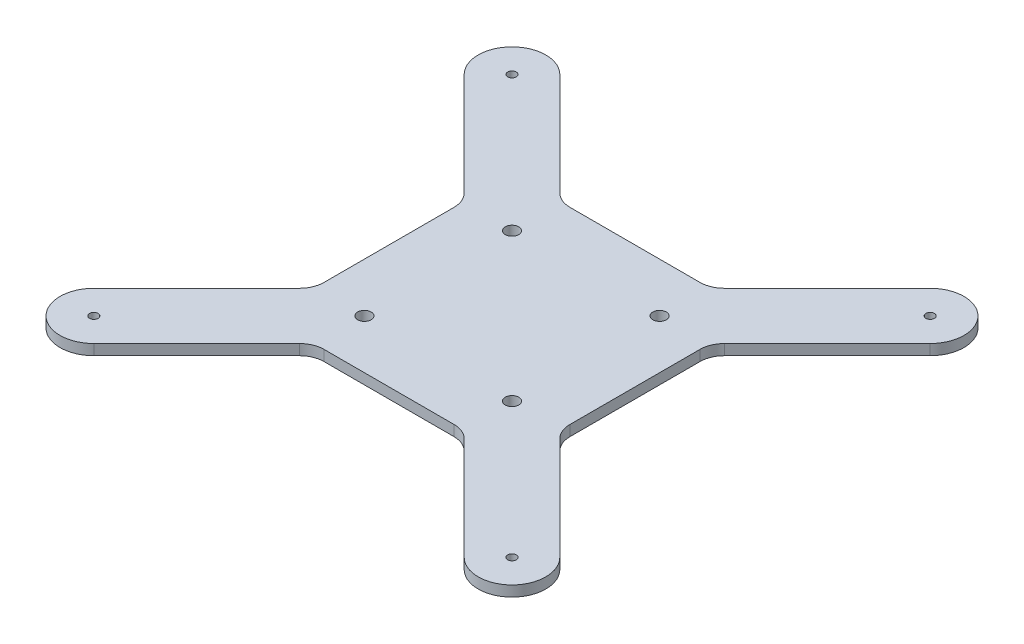
ISO-10303-21;
HEADER;
FILE_DESCRIPTION(('STEP AP214'),'2;1');
FILE_NAME('part.step','',(''),(''),'','','');
FILE_SCHEMA(('AUTOMOTIVE_DESIGN { 1 0 10303 214 1 1 1 1 }'));
ENDSEC;
DATA;
#1=APPLICATION_CONTEXT('core data for automotive mechanical design processes');
#2=APPLICATION_PROTOCOL_DEFINITION('international standard','automotive_design',2000,#1);
#3=PRODUCT_CONTEXT('',#1,'mechanical');
#4=PRODUCT('Part','Part','',(#3));
#5=PRODUCT_RELATED_PRODUCT_CATEGORY('part','',(#4));
#6=PRODUCT_DEFINITION_FORMATION('','',#4);
#7=PRODUCT_DEFINITION_CONTEXT('part definition',#1,'design');
#8=PRODUCT_DEFINITION('design','',#6,#7);
#9=PRODUCT_DEFINITION_SHAPE('','',#8);
#10=(LENGTH_UNIT() NAMED_UNIT(*) SI_UNIT(.MILLI.,.METRE.));
#11=(NAMED_UNIT(*) PLANE_ANGLE_UNIT() SI_UNIT($,.RADIAN.));
#12=(NAMED_UNIT(*) SI_UNIT($,.STERADIAN.) SOLID_ANGLE_UNIT());
#13=UNCERTAINTY_MEASURE_WITH_UNIT(LENGTH_MEASURE(1.E-05),#10,'distance_accuracy_value','');
#14=(GEOMETRIC_REPRESENTATION_CONTEXT(3) GLOBAL_UNCERTAINTY_ASSIGNED_CONTEXT((#13)) GLOBAL_UNIT_ASSIGNED_CONTEXT((#10,
#11,#12)) REPRESENTATION_CONTEXT('',''));
#15=CARTESIAN_POINT('',(0.,0.,0.));
#16=DIRECTION('',(0.,0.,1.));
#17=DIRECTION('',(1.,0.,0.));
#18=AXIS2_PLACEMENT_3D('',#15,#16,#17);
#19=CARTESIAN_POINT('',(0.,4.3,0.));
#20=DIRECTION('',(0.,-1.,0.));
#21=DIRECTION('',(0.,0.,-1.));
#22=AXIS2_PLACEMENT_3D('',#19,#20,#21);
#23=PLANE('',#22);
#24=DIRECTION('',(0.707106781186544,0.,0.707106781186551));
#25=VECTOR('',#24,1.);
#26=CARTESIAN_POINT('',(0.,4.3,-80.5545635173695));
#27=LINE('',#26,#25);
#28=CARTESIAN_POINT('',(-44.7227182413151,4.3,-125.277281758685));
#29=VERTEX_POINT('',#28);
#30=CARTESIAN_POINT('',(-2.92893218813448,4.3,-83.483495705504));
#31=VERTEX_POINT('',#30);
#32=EDGE_CURVE('E294',#29,#31,#27,.T.);
#33=ORIENTED_EDGE('',*,*,#32,.T.);
#34=CARTESIAN_POINT('',(-9.99999999999999,4.3,-76.4124278936386));
#35=DIRECTION('',(0.,-1.,0.));
#36=DIRECTION('',(0.,0.,-1.));
#37=AXIS2_PLACEMENT_3D('',#34,#35,#36);
#38=CIRCLE('',#37,10.);
#39=CARTESIAN_POINT('',(0.,4.3,-76.4124278936386));
#40=VERTEX_POINT('',#39);
#41=EDGE_CURVE('E47',#31,#40,#38,.T.);
#42=ORIENTED_EDGE('',*,*,#41,.T.);
#43=DIRECTION('',(0.,0.,1.));
#44=VECTOR('',#43,1.);
#45=CARTESIAN_POINT('',(0.,4.3,0.));
#46=LINE('',#45,#44);
#47=CARTESIAN_POINT('',(0.,4.3,-23.5875721063614));
#48=VERTEX_POINT('',#47);
#49=EDGE_CURVE('E344',#40,#48,#46,.T.);
#50=ORIENTED_EDGE('',*,*,#49,.T.);
#51=CARTESIAN_POINT('',(-10.,4.3,-23.5875721063614));
#52=DIRECTION('',(0.,-1.,0.));
#53=DIRECTION('',(0.,0.,-1.));
#54=AXIS2_PLACEMENT_3D('',#51,#52,#53);
#55=CIRCLE('',#54,10.);
#56=CARTESIAN_POINT('',(-2.92893218813448,4.3,-16.516504294496));
#57=VERTEX_POINT('',#56);
#58=EDGE_CURVE('E405',#48,#57,#55,.T.);
#59=ORIENTED_EDGE('',*,*,#58,.T.);
#60=DIRECTION('',(-0.707106781186544,0.,0.707106781186551));
#61=VECTOR('',#60,1.);
#62=CARTESIAN_POINT('',(-44.7227182413151,4.3,25.2772817586851));
#63=LINE('',#62,#61);
#64=CARTESIAN_POINT('',(-44.7227182413153,4.3,25.2772817586849));
#65=VERTEX_POINT('',#64);
#66=EDGE_CURVE('E226',#57,#65,#63,.T.);
#67=ORIENTED_EDGE('',*,*,#66,.T.);
#68=CARTESIAN_POINT('',(-34.9999999999996,4.3,34.9999999999993));
#69=DIRECTION('',(0.,1.,0.));
#70=DIRECTION('',(0.,0.,-1.));
#71=AXIS2_PLACEMENT_3D('',#68,#69,#70);
#72=CIRCLE('',#71,13.75);
#73=CARTESIAN_POINT('',(-25.277281758685,4.3,44.7227182413151));
#74=VERTEX_POINT('',#73);
#75=EDGE_CURVE('E222',#65,#74,#72,.T.);
#76=ORIENTED_EDGE('',*,*,#75,.T.);
#77=DIRECTION('',(0.707106781186551,0.,-0.707106781186544));
#78=VECTOR('',#77,1.);
#79=CARTESIAN_POINT('',(19.4454364826305,4.3,0.));
#80=LINE('',#79,#78);
#81=CARTESIAN_POINT('',(16.516504294496,4.3,2.92893218813449));
#82=VERTEX_POINT('',#81);
#83=EDGE_CURVE('E234',#74,#82,#80,.T.);
#84=ORIENTED_EDGE('',*,*,#83,.T.);
#85=CARTESIAN_POINT('',(23.5875721063615,4.3,10.));
#86=DIRECTION('',(0.,-1.,0.));
#87=DIRECTION('',(0.,0.,-1.));
#88=AXIS2_PLACEMENT_3D('',#85,#86,#87);
#89=CIRCLE('',#88,10.);
#90=CARTESIAN_POINT('',(23.5875721063615,4.3,0.));
#91=VERTEX_POINT('',#90);
#92=EDGE_CURVE('E409',#82,#91,#89,.T.);
#93=ORIENTED_EDGE('',*,*,#92,.T.);
#94=DIRECTION('',(1.,0.,0.));
#95=VECTOR('',#94,1.);
#96=CARTESIAN_POINT('',(0.,4.3,0.));
#97=LINE('',#96,#95);
#98=CARTESIAN_POINT('',(76.4124278936386,4.3,0.));
#99=VERTEX_POINT('',#98);
#100=EDGE_CURVE('E347',#91,#99,#97,.T.);
#101=ORIENTED_EDGE('',*,*,#100,.T.);
#102=CARTESIAN_POINT('',(76.4124278936386,4.3,10.));
#103=DIRECTION('',(0.,-1.,0.));
#104=DIRECTION('',(0.,0.,-1.));
#105=AXIS2_PLACEMENT_3D('',#102,#103,#104);
#106=CIRCLE('',#105,10.);
#107=CARTESIAN_POINT('',(83.483495705504,4.3,2.92893218813448));
#108=VERTEX_POINT('',#107);
#109=EDGE_CURVE('E413',#99,#108,#106,.T.);
#110=ORIENTED_EDGE('',*,*,#109,.T.);
#111=DIRECTION('',(0.707106781186551,0.,0.707106781186544));
#112=VECTOR('',#111,1.);
#113=CARTESIAN_POINT('',(125.277281758685,4.3,44.7227182413151));
#114=LINE('',#113,#112);
#115=CARTESIAN_POINT('',(125.277281758686,4.3,44.7227182413145));
#116=VERTEX_POINT('',#115);
#117=EDGE_CURVE('E260',#108,#116,#114,.T.);
#118=ORIENTED_EDGE('',*,*,#117,.T.);
#119=CARTESIAN_POINT('',(135.000000000001,4.3,34.9999999999996));
#120=DIRECTION('',(0.,1.,0.));
#121=DIRECTION('',(0.,0.,-1.));
#122=AXIS2_PLACEMENT_3D('',#119,#120,#121);
#123=CIRCLE('',#122,13.75);
#124=CARTESIAN_POINT('',(144.722718241315,4.3,25.277281758685));
#125=VERTEX_POINT('',#124);
#126=EDGE_CURVE('E262',#116,#125,#123,.T.);
#127=ORIENTED_EDGE('',*,*,#126,.T.);
#128=DIRECTION('',(-0.707106781186544,0.,-0.707106781186551));
#129=VECTOR('',#128,1.);
#130=CARTESIAN_POINT('',(100.,4.3,-19.4454364826305));
#131=LINE('',#130,#129);
#132=CARTESIAN_POINT('',(102.928932188134,4.3,-16.516504294496));
#133=VERTEX_POINT('',#132);
#134=EDGE_CURVE('E257',#125,#133,#131,.T.);
#135=ORIENTED_EDGE('',*,*,#134,.T.);
#136=CARTESIAN_POINT('',(110.,4.3,-23.5875721063615));
#137=DIRECTION('',(0.,-1.,0.));
#138=DIRECTION('',(0.,0.,-1.));
#139=AXIS2_PLACEMENT_3D('',#136,#137,#138);
#140=CIRCLE('',#139,10.);
#141=CARTESIAN_POINT('',(100.,4.3,-23.5875721063615));
#142=VERTEX_POINT('',#141);
#143=EDGE_CURVE('E417',#133,#142,#140,.T.);
#144=ORIENTED_EDGE('',*,*,#143,.T.);
#145=DIRECTION('',(0.,0.,-1.));
#146=VECTOR('',#145,1.);
#147=CARTESIAN_POINT('',(100.,4.3,0.));
#148=LINE('',#147,#146);
#149=CARTESIAN_POINT('',(100.,4.3,-76.4124278936385));
#150=VERTEX_POINT('',#149);
#151=EDGE_CURVE('E351',#142,#150,#148,.T.);
#152=ORIENTED_EDGE('',*,*,#151,.T.);
#153=CARTESIAN_POINT('',(110.,4.3,-76.4124278936385));
#154=DIRECTION('',(0.,-1.,0.));
#155=DIRECTION('',(0.,0.,-1.));
#156=AXIS2_PLACEMENT_3D('',#153,#154,#155);
#157=CIRCLE('',#156,10.);
#158=CARTESIAN_POINT('',(102.928932188134,4.3,-83.483495705504));
#159=VERTEX_POINT('',#158);
#160=EDGE_CURVE('E421',#150,#159,#157,.T.);
#161=ORIENTED_EDGE('',*,*,#160,.T.);
#162=DIRECTION('',(0.707106781186544,0.,-0.707106781186551));
#163=VECTOR('',#162,1.);
#164=CARTESIAN_POINT('',(144.722718241315,4.3,-125.277281758685));
#165=LINE('',#164,#163);
#166=CARTESIAN_POINT('',(144.722718241315,4.3,-125.277281758685));
#167=VERTEX_POINT('',#166);
#168=EDGE_CURVE('E287',#159,#167,#165,.T.);
#169=ORIENTED_EDGE('',*,*,#168,.T.);
#170=CARTESIAN_POINT('',(135.000000000001,4.3,-135.000000000001));
#171=DIRECTION('',(0.,1.,0.));
#172=DIRECTION('',(0.,0.,-1.));
#173=AXIS2_PLACEMENT_3D('',#170,#171,#172);
#174=CIRCLE('',#173,13.75);
#175=CARTESIAN_POINT('',(125.277281758685,4.3,-144.722718241315));
#176=VERTEX_POINT('',#175);
#177=EDGE_CURVE('E289',#167,#176,#174,.T.);
#178=ORIENTED_EDGE('',*,*,#177,.T.);
#179=DIRECTION('',(-0.707106781186551,0.,0.707106781186544));
#180=VECTOR('',#179,1.);
#181=CARTESIAN_POINT('',(80.5545635173695,4.3,-100.));
#182=LINE('',#181,#180);
#183=CARTESIAN_POINT('',(83.483495705504,4.3,-102.928932188134));
#184=VERTEX_POINT('',#183);
#185=EDGE_CURVE('E284',#176,#184,#182,.T.);
#186=ORIENTED_EDGE('',*,*,#185,.T.);
#187=CARTESIAN_POINT('',(76.4124278936386,4.3,-110.));
#188=DIRECTION('',(0.,-1.,0.));
#189=DIRECTION('',(0.,0.,-1.));
#190=AXIS2_PLACEMENT_3D('',#187,#188,#189);
#191=CIRCLE('',#190,10.);
#192=CARTESIAN_POINT('',(76.4124278936386,4.3,-100.));
#193=VERTEX_POINT('',#192);
#194=EDGE_CURVE('E425',#184,#193,#191,.T.);
#195=ORIENTED_EDGE('',*,*,#194,.T.);
#196=DIRECTION('',(-1.,0.,0.));
#197=VECTOR('',#196,1.);
#198=CARTESIAN_POINT('',(0.,4.3,-100.));
#199=LINE('',#198,#197);
#200=CARTESIAN_POINT('',(23.5875721063615,4.3,-100.));
#201=VERTEX_POINT('',#200);
#202=EDGE_CURVE('E354',#193,#201,#199,.T.);
#203=ORIENTED_EDGE('',*,*,#202,.T.);
#204=CARTESIAN_POINT('',(23.5875721063615,4.3,-110.));
#205=DIRECTION('',(0.,-1.,0.));
#206=DIRECTION('',(0.,0.,-1.));
#207=AXIS2_PLACEMENT_3D('',#204,#205,#206);
#208=CIRCLE('',#207,10.);
#209=CARTESIAN_POINT('',(16.516504294496,4.3,-102.928932188135));
#210=VERTEX_POINT('',#209);
#211=EDGE_CURVE('E429',#201,#210,#208,.T.);
#212=ORIENTED_EDGE('',*,*,#211,.T.);
#213=DIRECTION('',(-0.707106781186551,0.,-0.707106781186543));
#214=VECTOR('',#213,1.);
#215=CARTESIAN_POINT('',(-25.277281758685,4.3,-144.722718241315));
#216=LINE('',#215,#214);
#217=CARTESIAN_POINT('',(-25.277281758685,4.3,-144.722718241315));
#218=VERTEX_POINT('',#217);
#219=EDGE_CURVE('E301',#210,#218,#216,.T.);
#220=ORIENTED_EDGE('',*,*,#219,.T.);
#221=CARTESIAN_POINT('',(-35.,4.3,-135.));
#222=DIRECTION('',(0.,1.,0.));
#223=DIRECTION('',(0.,0.,-1.));
#224=AXIS2_PLACEMENT_3D('',#221,#222,#223);
#225=CIRCLE('',#224,13.75);
#226=EDGE_CURVE('E298',#218,#29,#225,.T.);
#227=ORIENTED_EDGE('',*,*,#226,.T.);
#228=EDGE_LOOP('',(#33,#42,#50,#59,#67,#76,#84,#93,#101,#110,#118,#127,#135,#144,#152,#161,#169,
#178,#186,#195,#203,#212,#220,#227));
#229=FACE_BOUND('',#228,.T.);
#230=CARTESIAN_POINT('',(20.,4.3,-80.));
#231=DIRECTION('',(0.,1.,0.));
#232=DIRECTION('',(0.,0.,1.));
#233=AXIS2_PLACEMENT_3D('',#230,#231,#232);
#234=CIRCLE('',#233,2.75);
#235=CARTESIAN_POINT('',(20.,4.3,-77.25));
#236=VERTEX_POINT('',#235);
#237=EDGE_CURVE('E338',#236,#236,#234,.T.);
#238=ORIENTED_EDGE('',*,*,#237,.F.);
#239=EDGE_LOOP('',(#238));
#240=FACE_BOUND('',#239,.T.);
#241=CARTESIAN_POINT('',(80.,4.3,-80.));
#242=DIRECTION('',(0.,1.,0.));
#243=DIRECTION('',(0.,0.,-1.));
#244=AXIS2_PLACEMENT_3D('',#241,#242,#243);
#245=CIRCLE('',#244,2.75000000000001);
#246=CARTESIAN_POINT('',(80.,4.3,-82.75));
#247=VERTEX_POINT('',#246);
#248=EDGE_CURVE('E332',#247,#247,#245,.T.);
#249=ORIENTED_EDGE('',*,*,#248,.F.);
#250=EDGE_LOOP('',(#249));
#251=FACE_BOUND('',#250,.T.);
#252=CARTESIAN_POINT('',(80.,4.3,-20.));
#253=DIRECTION('',(0.,1.,0.));
#254=DIRECTION('',(0.,0.,1.));
#255=AXIS2_PLACEMENT_3D('',#252,#253,#254);
#256=CIRCLE('',#255,2.75000000000001);
#257=CARTESIAN_POINT('',(80.,4.3,-17.25));
#258=VERTEX_POINT('',#257);
#259=EDGE_CURVE('E326',#258,#258,#256,.T.);
#260=ORIENTED_EDGE('',*,*,#259,.F.);
#261=EDGE_LOOP('',(#260));
#262=FACE_BOUND('',#261,.T.);
#263=CARTESIAN_POINT('',(20.,4.3,-20.));
#264=DIRECTION('',(0.,1.,0.));
#265=DIRECTION('',(0.,0.,-1.));
#266=AXIS2_PLACEMENT_3D('',#263,#264,#265);
#267=CIRCLE('',#266,2.75);
#268=CARTESIAN_POINT('',(20.,4.3,-22.75));
#269=VERTEX_POINT('',#268);
#270=EDGE_CURVE('E320',#269,#269,#267,.T.);
#271=ORIENTED_EDGE('',*,*,#270,.F.);
#272=EDGE_LOOP('',(#271));
#273=FACE_BOUND('',#272,.T.);
#274=CARTESIAN_POINT('',(-35.,4.3,-135.));
#275=DIRECTION('',(0.,1.,0.));
#276=DIRECTION('',(0.,0.,1.));
#277=AXIS2_PLACEMENT_3D('',#274,#275,#276);
#278=CIRCLE('',#277,1.75);
#279=CARTESIAN_POINT('',(-35.,4.3,-133.25));
#280=VERTEX_POINT('',#279);
#281=EDGE_CURVE('E303',#280,#280,#278,.T.);
#282=ORIENTED_EDGE('',*,*,#281,.F.);
#283=EDGE_LOOP('',(#282));
#284=FACE_BOUND('',#283,.T.);
#285=CARTESIAN_POINT('',(135.,4.3,-135.));
#286=DIRECTION('',(0.,1.,0.));
#287=DIRECTION('',(0.,0.,-1.));
#288=AXIS2_PLACEMENT_3D('',#285,#286,#287);
#289=CIRCLE('',#288,1.75000000000001);
#290=CARTESIAN_POINT('',(135.,4.3,-136.75));
#291=VERTEX_POINT('',#290);
#292=EDGE_CURVE('E271',#291,#291,#289,.T.);
#293=ORIENTED_EDGE('',*,*,#292,.F.);
#294=EDGE_LOOP('',(#293));
#295=FACE_BOUND('',#294,.T.);
#296=CARTESIAN_POINT('',(135.,4.3,35.));
#297=DIRECTION('',(0.,1.,0.));
#298=DIRECTION('',(0.,0.,1.));
#299=AXIS2_PLACEMENT_3D('',#296,#297,#298);
#300=CIRCLE('',#299,1.75000000000001);
#301=CARTESIAN_POINT('',(135.,4.3,36.75));
#302=VERTEX_POINT('',#301);
#303=EDGE_CURVE('E244',#302,#302,#300,.T.);
#304=ORIENTED_EDGE('',*,*,#303,.F.);
#305=EDGE_LOOP('',(#304));
#306=FACE_BOUND('',#305,.T.);
#307=CARTESIAN_POINT('',(-35.,4.3,35.));
#308=DIRECTION('',(0.,1.,0.));
#309=DIRECTION('',(0.,0.,-1.));
#310=AXIS2_PLACEMENT_3D('',#307,#308,#309);
#311=CIRCLE('',#310,1.75);
#312=CARTESIAN_POINT('',(-35.,4.3,33.25));
#313=VERTEX_POINT('',#312);
#314=EDGE_CURVE('E223',#313,#313,#311,.T.);
#315=ORIENTED_EDGE('',*,*,#314,.F.);
#316=EDGE_LOOP('',(#315));
#317=FACE_BOUND('',#316,.T.);
#318=ADVANCED_FACE('F39',(#229,#240,#251,#262,#273,#284,#295,#306,#317),#23,.F.);
#319=CARTESIAN_POINT('',(0.,0.,0.));
#320=DIRECTION('',(0.,-1.,0.));
#321=DIRECTION('',(0.,0.,-1.));
#322=AXIS2_PLACEMENT_3D('',#319,#320,#321);
#323=PLANE('',#322);
#324=DIRECTION('',(-0.707106781186544,0.,0.707106781186552));
#325=VECTOR('',#324,1.);
#326=CARTESIAN_POINT('',(-44.7227182413151,0.,25.2772817586851));
#327=LINE('',#326,#325);
#328=CARTESIAN_POINT('',(-2.92893218813448,0.,-16.516504294496));
#329=VERTEX_POINT('',#328);
#330=CARTESIAN_POINT('',(-44.7227182413149,0.,25.2772817586849));
#331=VERTEX_POINT('',#330);
#332=EDGE_CURVE('E199',#329,#331,#327,.T.);
#333=ORIENTED_EDGE('',*,*,#332,.F.);
#334=CARTESIAN_POINT('',(-10.,0.,-23.5875721063614));
#335=DIRECTION('',(0.,-1.,0.));
#336=DIRECTION('',(0.,0.,-1.));
#337=AXIS2_PLACEMENT_3D('',#334,#335,#336);
#338=CIRCLE('',#337,10.);
#339=CARTESIAN_POINT('',(0.,0.,-23.5875721063614));
#340=VERTEX_POINT('',#339);
#341=EDGE_CURVE('E407',#329,#340,#338,.F.);
#342=ORIENTED_EDGE('',*,*,#341,.T.);
#343=DIRECTION('',(0.,0.,1.));
#344=VECTOR('',#343,1.);
#345=CARTESIAN_POINT('',(0.,0.,0.));
#346=LINE('',#345,#344);
#347=CARTESIAN_POINT('',(0.,0.,-76.4124278936386));
#348=VERTEX_POINT('',#347);
#349=EDGE_CURVE('E341',#348,#340,#346,.T.);
#350=ORIENTED_EDGE('',*,*,#349,.F.);
#351=CARTESIAN_POINT('',(-9.99999999999999,0.,-76.4124278936386));
#352=DIRECTION('',(0.,-1.,0.));
#353=DIRECTION('',(0.,0.,-1.));
#354=AXIS2_PLACEMENT_3D('',#351,#352,#353);
#355=CIRCLE('',#354,10.);
#356=CARTESIAN_POINT('',(-2.92893218813448,0.,-83.483495705504));
#357=VERTEX_POINT('',#356);
#358=EDGE_CURVE('E11',#348,#357,#355,.F.);
#359=ORIENTED_EDGE('',*,*,#358,.T.);
#360=DIRECTION('',(0.707106781186544,0.,0.707106781186551));
#361=VECTOR('',#360,1.);
#362=CARTESIAN_POINT('',(0.,0.,-80.5545635173695));
#363=LINE('',#362,#361);
#364=CARTESIAN_POINT('',(-44.7227182413151,0.,-125.277281758685));
#365=VERTEX_POINT('',#364);
#366=EDGE_CURVE('E281',#365,#357,#363,.T.);
#367=ORIENTED_EDGE('',*,*,#366,.F.);
#368=CARTESIAN_POINT('',(-35.,0.,-135.));
#369=DIRECTION('',(0.,-1.,0.));
#370=DIRECTION('',(0.,0.,-1.));
#371=AXIS2_PLACEMENT_3D('',#368,#369,#370);
#372=CIRCLE('',#371,13.75);
#373=CARTESIAN_POINT('',(-25.277281758685,0.,-144.722718241315));
#374=VERTEX_POINT('',#373);
#375=EDGE_CURVE('E311',#374,#365,#372,.F.);
#376=ORIENTED_EDGE('',*,*,#375,.F.);
#377=DIRECTION('',(-0.707106781186551,0.,-0.707106781186544));
#378=VECTOR('',#377,1.);
#379=CARTESIAN_POINT('',(-25.277281758685,0.,-144.722718241315));
#380=LINE('',#379,#378);
#381=CARTESIAN_POINT('',(16.5165042944961,0.,-102.928932188134));
#382=VERTEX_POINT('',#381);
#383=EDGE_CURVE('E315',#382,#374,#380,.T.);
#384=ORIENTED_EDGE('',*,*,#383,.F.);
#385=CARTESIAN_POINT('',(23.5875721063615,0.,-110.));
#386=DIRECTION('',(0.,-1.,0.));
#387=DIRECTION('',(0.,0.,-1.));
#388=AXIS2_PLACEMENT_3D('',#385,#386,#387);
#389=CIRCLE('',#388,10.);
#390=CARTESIAN_POINT('',(23.5875721063615,0.,-100.));
#391=VERTEX_POINT('',#390);
#392=EDGE_CURVE('E431',#382,#391,#389,.F.);
#393=ORIENTED_EDGE('',*,*,#392,.T.);
#394=DIRECTION('',(-1.,0.,0.));
#395=VECTOR('',#394,1.);
#396=CARTESIAN_POINT('',(0.,0.,-100.));
#397=LINE('',#396,#395);
#398=CARTESIAN_POINT('',(76.4124278936386,0.,-100.));
#399=VERTEX_POINT('',#398);
#400=EDGE_CURVE('E348',#399,#391,#397,.T.);
#401=ORIENTED_EDGE('',*,*,#400,.F.);
#402=CARTESIAN_POINT('',(76.4124278936386,0.,-110.));
#403=DIRECTION('',(0.,-1.,0.));
#404=DIRECTION('',(0.,0.,-1.));
#405=AXIS2_PLACEMENT_3D('',#402,#403,#404);
#406=CIRCLE('',#405,10.);
#407=CARTESIAN_POINT('',(83.483495705504,0.,-102.928932188134));
#408=VERTEX_POINT('',#407);
#409=EDGE_CURVE('E427',#399,#408,#406,.F.);
#410=ORIENTED_EDGE('',*,*,#409,.T.);
#411=DIRECTION('',(-0.707106781186551,0.,0.707106781186544));
#412=VECTOR('',#411,1.);
#413=CARTESIAN_POINT('',(80.5545635173695,0.,-100.));
#414=LINE('',#413,#412);
#415=CARTESIAN_POINT('',(125.277281758685,0.,-144.722718241315));
#416=VERTEX_POINT('',#415);
#417=EDGE_CURVE('E278',#416,#408,#414,.T.);
#418=ORIENTED_EDGE('',*,*,#417,.F.);
#419=CARTESIAN_POINT('',(135.000000000001,0.,-135.000000000001));
#420=DIRECTION('',(0.,-1.,0.));
#421=DIRECTION('',(0.,0.,-1.));
#422=AXIS2_PLACEMENT_3D('',#419,#420,#421);
#423=CIRCLE('',#422,13.75);
#424=CARTESIAN_POINT('',(144.722718241315,0.,-125.277281758685));
#425=VERTEX_POINT('',#424);
#426=EDGE_CURVE('E274',#425,#416,#423,.F.);
#427=ORIENTED_EDGE('',*,*,#426,.F.);
#428=DIRECTION('',(0.707106781186544,0.,-0.707106781186551));
#429=VECTOR('',#428,1.);
#430=CARTESIAN_POINT('',(144.722718241315,0.,-125.277281758685));
#431=LINE('',#430,#429);
#432=CARTESIAN_POINT('',(102.928932188134,0.,-83.483495705504));
#433=VERTEX_POINT('',#432);
#434=EDGE_CURVE('E270',#433,#425,#431,.T.);
#435=ORIENTED_EDGE('',*,*,#434,.F.);
#436=CARTESIAN_POINT('',(110.,0.,-76.4124278936385));
#437=DIRECTION('',(0.,-1.,0.));
#438=DIRECTION('',(0.,0.,-1.));
#439=AXIS2_PLACEMENT_3D('',#436,#437,#438);
#440=CIRCLE('',#439,10.);
#441=CARTESIAN_POINT('',(100.,0.,-76.4124278936385));
#442=VERTEX_POINT('',#441);
#443=EDGE_CURVE('E423',#433,#442,#440,.F.);
#444=ORIENTED_EDGE('',*,*,#443,.T.);
#445=DIRECTION('',(0.,0.,-1.));
#446=VECTOR('',#445,1.);
#447=CARTESIAN_POINT('',(100.,0.,0.));
#448=LINE('',#447,#446);
#449=CARTESIAN_POINT('',(100.,0.,-23.5875721063615));
#450=VERTEX_POINT('',#449);
#451=EDGE_CURVE('E363',#450,#442,#448,.T.);
#452=ORIENTED_EDGE('',*,*,#451,.F.);
#453=CARTESIAN_POINT('',(110.,0.,-23.5875721063615));
#454=DIRECTION('',(0.,-1.,0.));
#455=DIRECTION('',(0.,0.,-1.));
#456=AXIS2_PLACEMENT_3D('',#453,#454,#455);
#457=CIRCLE('',#456,10.);
#458=CARTESIAN_POINT('',(102.928932188134,0.,-16.516504294496));
#459=VERTEX_POINT('',#458);
#460=EDGE_CURVE('E419',#450,#459,#457,.F.);
#461=ORIENTED_EDGE('',*,*,#460,.T.);
#462=DIRECTION('',(-0.707106781186544,0.,-0.707106781186551));
#463=VECTOR('',#462,1.);
#464=CARTESIAN_POINT('',(100.,0.,-19.4454364826305));
#465=LINE('',#464,#463);
#466=CARTESIAN_POINT('',(144.722718241316,0.,25.2772817586844));
#467=VERTEX_POINT('',#466);
#468=EDGE_CURVE('E251',#467,#459,#465,.T.);
#469=ORIENTED_EDGE('',*,*,#468,.F.);
#470=CARTESIAN_POINT('',(135.000000000001,0.,34.9999999999996));
#471=DIRECTION('',(0.,-1.,0.));
#472=DIRECTION('',(0.,0.,-1.));
#473=AXIS2_PLACEMENT_3D('',#470,#471,#472);
#474=CIRCLE('',#473,13.75);
#475=CARTESIAN_POINT('',(125.277281758684,0.,44.7227182413145));
#476=VERTEX_POINT('',#475);
#477=EDGE_CURVE('E247',#476,#467,#474,.F.);
#478=ORIENTED_EDGE('',*,*,#477,.F.);
#479=DIRECTION('',(0.707106781186552,0.,0.707106781186544));
#480=VECTOR('',#479,1.);
#481=CARTESIAN_POINT('',(125.277281758685,0.,44.7227182413151));
#482=LINE('',#481,#480);
#483=CARTESIAN_POINT('',(83.483495705504,0.,2.92893218813448));
#484=VERTEX_POINT('',#483);
#485=EDGE_CURVE('E243',#484,#476,#482,.T.);
#486=ORIENTED_EDGE('',*,*,#485,.F.);
#487=CARTESIAN_POINT('',(76.4124278936386,0.,10.));
#488=DIRECTION('',(0.,-1.,0.));
#489=DIRECTION('',(0.,0.,-1.));
#490=AXIS2_PLACEMENT_3D('',#487,#488,#489);
#491=CIRCLE('',#490,10.);
#492=CARTESIAN_POINT('',(76.4124278936386,0.,0.));
#493=VERTEX_POINT('',#492);
#494=EDGE_CURVE('E415',#484,#493,#491,.F.);
#495=ORIENTED_EDGE('',*,*,#494,.T.);
#496=DIRECTION('',(1.,0.,0.));
#497=VECTOR('',#496,1.);
#498=CARTESIAN_POINT('',(0.,0.,0.));
#499=LINE('',#498,#497);
#500=CARTESIAN_POINT('',(23.5875721063615,0.,0.));
#501=VERTEX_POINT('',#500);
#502=EDGE_CURVE('E360',#501,#493,#499,.T.);
#503=ORIENTED_EDGE('',*,*,#502,.F.);
#504=CARTESIAN_POINT('',(23.5875721063615,0.,10.));
#505=DIRECTION('',(0.,-1.,0.));
#506=DIRECTION('',(0.,0.,-1.));
#507=AXIS2_PLACEMENT_3D('',#504,#505,#506);
#508=CIRCLE('',#507,10.);
#509=CARTESIAN_POINT('',(16.516504294496,0.,2.92893218813449));
#510=VERTEX_POINT('',#509);
#511=EDGE_CURVE('E411',#501,#510,#508,.F.);
#512=ORIENTED_EDGE('',*,*,#511,.T.);
#513=DIRECTION('',(0.707106781186551,0.,-0.707106781186544));
#514=VECTOR('',#513,1.);
#515=CARTESIAN_POINT('',(19.4454364826305,0.,0.));
#516=LINE('',#515,#514);
#517=CARTESIAN_POINT('',(-25.2772817586852,0.,44.7227182413149));
#518=VERTEX_POINT('',#517);
#519=EDGE_CURVE('E216',#518,#510,#516,.T.);
#520=ORIENTED_EDGE('',*,*,#519,.F.);
#521=CARTESIAN_POINT('',(-34.9999999999996,0.,34.9999999999993));
#522=DIRECTION('',(0.,-1.,0.));
#523=DIRECTION('',(0.,0.,-1.));
#524=AXIS2_PLACEMENT_3D('',#521,#522,#523);
#525=CIRCLE('',#524,13.75);
#526=EDGE_CURVE('E212',#331,#518,#525,.F.);
#527=ORIENTED_EDGE('',*,*,#526,.F.);
#528=EDGE_LOOP('',(#333,#342,#350,#359,#367,#376,#384,#393,#401,#410,#418,#427,#435,#444,#452,
#461,#469,#478,#486,#495,#503,#512,#520,#527));
#529=FACE_BOUND('',#528,.T.);
#530=CARTESIAN_POINT('',(80.,0.,-20.));
#531=DIRECTION('',(0.,1.,0.));
#532=DIRECTION('',(0.,0.,1.));
#533=AXIS2_PLACEMENT_3D('',#530,#531,#532);
#534=CIRCLE('',#533,2.75000000000001);
#535=CARTESIAN_POINT('',(80.,0.,-17.25));
#536=VERTEX_POINT('',#535);
#537=EDGE_CURVE('E323',#536,#536,#534,.T.);
#538=ORIENTED_EDGE('',*,*,#537,.T.);
#539=EDGE_LOOP('',(#538));
#540=FACE_BOUND('',#539,.T.);
#541=CARTESIAN_POINT('',(20.,0.,-80.));
#542=DIRECTION('',(0.,1.,0.));
#543=DIRECTION('',(0.,0.,1.));
#544=AXIS2_PLACEMENT_3D('',#541,#542,#543);
#545=CIRCLE('',#544,2.75);
#546=CARTESIAN_POINT('',(20.,0.,-77.25));
#547=VERTEX_POINT('',#546);
#548=EDGE_CURVE('E335',#547,#547,#545,.T.);
#549=ORIENTED_EDGE('',*,*,#548,.T.);
#550=EDGE_LOOP('',(#549));
#551=FACE_BOUND('',#550,.T.);
#552=CARTESIAN_POINT('',(80.,0.,-80.));
#553=DIRECTION('',(0.,1.,0.));
#554=DIRECTION('',(0.,0.,-1.));
#555=AXIS2_PLACEMENT_3D('',#552,#553,#554);
#556=CIRCLE('',#555,2.75000000000001);
#557=CARTESIAN_POINT('',(80.,0.,-82.75));
#558=VERTEX_POINT('',#557);
#559=EDGE_CURVE('E329',#558,#558,#556,.T.);
#560=ORIENTED_EDGE('',*,*,#559,.T.);
#561=EDGE_LOOP('',(#560));
#562=FACE_BOUND('',#561,.T.);
#563=CARTESIAN_POINT('',(20.,0.,-20.));
#564=DIRECTION('',(0.,1.,0.));
#565=DIRECTION('',(0.,0.,-1.));
#566=AXIS2_PLACEMENT_3D('',#563,#564,#565);
#567=CIRCLE('',#566,2.75);
#568=CARTESIAN_POINT('',(20.,0.,-22.75));
#569=VERTEX_POINT('',#568);
#570=EDGE_CURVE('E309',#569,#569,#567,.T.);
#571=ORIENTED_EDGE('',*,*,#570,.T.);
#572=EDGE_LOOP('',(#571));
#573=FACE_BOUND('',#572,.T.);
#574=CARTESIAN_POINT('',(-35.,0.,-135.));
#575=DIRECTION('',(0.,-1.,0.));
#576=DIRECTION('',(0.,0.,-1.));
#577=AXIS2_PLACEMENT_3D('',#574,#575,#576);
#578=CIRCLE('',#577,1.75);
#579=CARTESIAN_POINT('',(-35.,0.,-136.75));
#580=VERTEX_POINT('',#579);
#581=EDGE_CURVE('E297',#580,#580,#578,.F.);
#582=ORIENTED_EDGE('',*,*,#581,.T.);
#583=EDGE_LOOP('',(#582));
#584=FACE_BOUND('',#583,.T.);
#585=CARTESIAN_POINT('',(135.,0.,-135.));
#586=DIRECTION('',(0.,-1.,0.));
#587=DIRECTION('',(0.,0.,-1.));
#588=AXIS2_PLACEMENT_3D('',#585,#586,#587);
#589=CIRCLE('',#588,1.75000000000001);
#590=CARTESIAN_POINT('',(135.,0.,-136.75));
#591=VERTEX_POINT('',#590);
#592=EDGE_CURVE('E254',#591,#591,#589,.F.);
#593=ORIENTED_EDGE('',*,*,#592,.T.);
#594=EDGE_LOOP('',(#593));
#595=FACE_BOUND('',#594,.T.);
#596=CARTESIAN_POINT('',(135.,0.,35.));
#597=DIRECTION('',(0.,-1.,0.));
#598=DIRECTION('',(0.,0.,-1.));
#599=AXIS2_PLACEMENT_3D('',#596,#597,#598);
#600=CIRCLE('',#599,1.75000000000001);
#601=CARTESIAN_POINT('',(135.,0.,33.25));
#602=VERTEX_POINT('',#601);
#603=EDGE_CURVE('E231',#602,#602,#600,.F.);
#604=ORIENTED_EDGE('',*,*,#603,.T.);
#605=EDGE_LOOP('',(#604));
#606=FACE_BOUND('',#605,.T.);
#607=CARTESIAN_POINT('',(-35.,0.,35.));
#608=DIRECTION('',(0.,-1.,0.));
#609=DIRECTION('',(0.,0.,-1.));
#610=AXIS2_PLACEMENT_3D('',#607,#608,#609);
#611=CIRCLE('',#610,1.75);
#612=CARTESIAN_POINT('',(-35.,0.,33.25));
#613=VERTEX_POINT('',#612);
#614=EDGE_CURVE('E232',#613,#613,#611,.F.);
#615=ORIENTED_EDGE('',*,*,#614,.T.);
#616=EDGE_LOOP('',(#615));
#617=FACE_BOUND('',#616,.T.);
#618=ADVANCED_FACE('F213',(#529,#540,#551,#562,#573,#584,#595,#606,#617),#323,.T.);
#619=CARTESIAN_POINT('',(0.,4.3,0.));
#620=DIRECTION('',(1.,0.,0.));
#621=DIRECTION('',(0.,0.,-1.));
#622=AXIS2_PLACEMENT_3D('',#619,#620,#621);
#623=PLANE('',#622);
#624=ORIENTED_EDGE('',*,*,#349,.T.);
#625=DIRECTION('',(0.,1.,0.));
#626=VECTOR('',#625,1.);
#627=CARTESIAN_POINT('',(0.,4.3,-23.5875721063614));
#628=LINE('',#627,#626);
#629=EDGE_CURVE('E369',#340,#48,#628,.T.);
#630=ORIENTED_EDGE('',*,*,#629,.T.);
#631=ORIENTED_EDGE('',*,*,#49,.F.);
#632=DIRECTION('',(0.,1.,0.));
#633=VECTOR('',#632,1.);
#634=CARTESIAN_POINT('',(0.,4.3,-76.4124278936386));
#635=LINE('',#634,#633);
#636=EDGE_CURVE('E357',#40,#348,#635,.F.);
#637=ORIENTED_EDGE('',*,*,#636,.T.);
#638=EDGE_LOOP('',(#624,#630,#631,#637));
#639=FACE_BOUND('',#638,.T.);
#640=ADVANCED_FACE('F437',(#639),#623,.F.);
#641=CARTESIAN_POINT('',(0.,4.3,0.));
#642=DIRECTION('',(0.,0.,-1.));
#643=DIRECTION('',(-1.,0.,0.));
#644=AXIS2_PLACEMENT_3D('',#641,#642,#643);
#645=PLANE('',#644);
#646=ORIENTED_EDGE('',*,*,#100,.F.);
#647=DIRECTION('',(0.,1.,0.));
#648=VECTOR('',#647,1.);
#649=CARTESIAN_POINT('',(23.5875721063615,4.3,0.));
#650=LINE('',#649,#648);
#651=EDGE_CURVE('E379',#91,#501,#650,.F.);
#652=ORIENTED_EDGE('',*,*,#651,.T.);
#653=ORIENTED_EDGE('',*,*,#502,.T.);
#654=DIRECTION('',(0.,1.,0.));
#655=VECTOR('',#654,1.);
#656=CARTESIAN_POINT('',(76.4124278936386,4.3,0.));
#657=LINE('',#656,#655);
#658=EDGE_CURVE('E376',#493,#99,#657,.T.);
#659=ORIENTED_EDGE('',*,*,#658,.T.);
#660=EDGE_LOOP('',(#646,#652,#653,#659));
#661=FACE_BOUND('',#660,.T.);
#662=ADVANCED_FACE('F513',(#661),#645,.F.);
#663=CARTESIAN_POINT('',(100.,4.3,0.));
#664=DIRECTION('',(-1.,0.,0.));
#665=DIRECTION('',(0.,0.,1.));
#666=AXIS2_PLACEMENT_3D('',#663,#664,#665);
#667=PLANE('',#666);
#668=ORIENTED_EDGE('',*,*,#151,.F.);
#669=DIRECTION('',(0.,1.,0.));
#670=VECTOR('',#669,1.);
#671=CARTESIAN_POINT('',(100.,4.3,-23.5875721063615));
#672=LINE('',#671,#670);
#673=EDGE_CURVE('E389',#142,#450,#672,.F.);
#674=ORIENTED_EDGE('',*,*,#673,.T.);
#675=ORIENTED_EDGE('',*,*,#451,.T.);
#676=DIRECTION('',(0.,1.,0.));
#677=VECTOR('',#676,1.);
#678=CARTESIAN_POINT('',(100.,4.3,-76.4124278936385));
#679=LINE('',#678,#677);
#680=EDGE_CURVE('E386',#442,#150,#679,.T.);
#681=ORIENTED_EDGE('',*,*,#680,.T.);
#682=EDGE_LOOP('',(#668,#674,#675,#681));
#683=FACE_BOUND('',#682,.T.);
#684=ADVANCED_FACE('F484',(#683),#667,.F.);
#685=CARTESIAN_POINT('',(0.,4.3,-100.));
#686=DIRECTION('',(0.,0.,1.));
#687=DIRECTION('',(1.,0.,0.));
#688=AXIS2_PLACEMENT_3D('',#685,#686,#687);
#689=PLANE('',#688);
#690=ORIENTED_EDGE('',*,*,#202,.F.);
#691=DIRECTION('',(0.,1.,0.));
#692=VECTOR('',#691,1.);
#693=CARTESIAN_POINT('',(76.4124278936386,4.3,-100.));
#694=LINE('',#693,#692);
#695=EDGE_CURVE('E399',#193,#399,#694,.F.);
#696=ORIENTED_EDGE('',*,*,#695,.T.);
#697=ORIENTED_EDGE('',*,*,#400,.T.);
#698=DIRECTION('',(0.,1.,0.));
#699=VECTOR('',#698,1.);
#700=CARTESIAN_POINT('',(23.5875721063615,4.3,-100.));
#701=LINE('',#700,#699);
#702=EDGE_CURVE('E396',#391,#201,#701,.T.);
#703=ORIENTED_EDGE('',*,*,#702,.T.);
#704=EDGE_LOOP('',(#690,#696,#697,#703));
#705=FACE_BOUND('',#704,.T.);
#706=ADVANCED_FACE('F460',(#705),#689,.F.);
#707=CARTESIAN_POINT('',(20.,4.3,-80.));
#708=DIRECTION('',(0.,-1.,0.));
#709=DIRECTION('',(0.,0.,-1.));
#710=AXIS2_PLACEMENT_3D('',#707,#708,#709);
#711=CYLINDRICAL_SURFACE('',#710,2.75);
#712=ORIENTED_EDGE('',*,*,#237,.T.);
#713=EDGE_LOOP('',(#712));
#714=FACE_BOUND('',#713,.T.);
#715=ORIENTED_EDGE('',*,*,#548,.F.);
#716=EDGE_LOOP('',(#715));
#717=FACE_BOUND('',#716,.T.);
#718=ADVANCED_FACE('F542',(#714,#717),#711,.F.);
#719=CARTESIAN_POINT('',(80.,4.3,-80.));
#720=DIRECTION('',(0.,-1.,0.));
#721=DIRECTION('',(0.,0.,-1.));
#722=AXIS2_PLACEMENT_3D('',#719,#720,#721);
#723=CYLINDRICAL_SURFACE('',#722,2.75000000000001);
#724=ORIENTED_EDGE('',*,*,#248,.T.);
#725=EDGE_LOOP('',(#724));
#726=FACE_BOUND('',#725,.T.);
#727=ORIENTED_EDGE('',*,*,#559,.F.);
#728=EDGE_LOOP('',(#727));
#729=FACE_BOUND('',#728,.T.);
#730=ADVANCED_FACE('F764',(#726,#729),#723,.F.);
#731=CARTESIAN_POINT('',(80.,4.3,-20.));
#732=DIRECTION('',(0.,-1.,0.));
#733=DIRECTION('',(0.,0.,-1.));
#734=AXIS2_PLACEMENT_3D('',#731,#732,#733);
#735=CYLINDRICAL_SURFACE('',#734,2.75000000000001);
#736=ORIENTED_EDGE('',*,*,#259,.T.);
#737=EDGE_LOOP('',(#736));
#738=FACE_BOUND('',#737,.T.);
#739=ORIENTED_EDGE('',*,*,#537,.F.);
#740=EDGE_LOOP('',(#739));
#741=FACE_BOUND('',#740,.T.);
#742=ADVANCED_FACE('F754',(#738,#741),#735,.F.);
#743=CARTESIAN_POINT('',(20.,4.3,-20.));
#744=DIRECTION('',(0.,-1.,0.));
#745=DIRECTION('',(0.,0.,-1.));
#746=AXIS2_PLACEMENT_3D('',#743,#744,#745);
#747=CYLINDRICAL_SURFACE('',#746,2.75);
#748=ORIENTED_EDGE('',*,*,#270,.T.);
#749=EDGE_LOOP('',(#748));
#750=FACE_BOUND('',#749,.T.);
#751=ORIENTED_EDGE('',*,*,#570,.F.);
#752=EDGE_LOOP('',(#751));
#753=FACE_BOUND('',#752,.T.);
#754=ADVANCED_FACE('F579',(#750,#753),#747,.F.);
#755=CARTESIAN_POINT('',(0.,-96.4429111656901,-80.5545635173695));
#756=DIRECTION('',(-0.707106781186551,0.,0.707106781186544));
#757=DIRECTION('',(0.707106781186544,0.,0.707106781186551));
#758=AXIS2_PLACEMENT_3D('',#755,#756,#757);
#759=PLANE('',#758);
#760=ORIENTED_EDGE('',*,*,#366,.T.);
#761=DIRECTION('',(0.,1.,0.));
#762=VECTOR('',#761,1.);
#763=CARTESIAN_POINT('',(-2.92893218813448,-96.4429111656901,-83.483495705504));
#764=LINE('',#763,#762);
#765=EDGE_CURVE('E403',#357,#31,#764,.T.);
#766=ORIENTED_EDGE('',*,*,#765,.T.);
#767=ORIENTED_EDGE('',*,*,#32,.F.);
#768=DIRECTION('',(0.,1.,0.));
#769=VECTOR('',#768,1.);
#770=CARTESIAN_POINT('',(-44.7227182413151,-96.4429111656901,-125.277281758685));
#771=LINE('',#770,#769);
#772=EDGE_CURVE('E314',#365,#29,#771,.T.);
#773=ORIENTED_EDGE('',*,*,#772,.F.);
#774=EDGE_LOOP('',(#760,#766,#767,#773));
#775=FACE_BOUND('',#774,.T.);
#776=ADVANCED_FACE('F440',(#775),#759,.T.);
#777=CARTESIAN_POINT('',(-35.,-96.4429111656901,-135.));
#778=DIRECTION('',(0.,1.,0.));
#779=DIRECTION('',(0.,0.,1.));
#780=AXIS2_PLACEMENT_3D('',#777,#778,#779);
#781=CYLINDRICAL_SURFACE('',#780,13.75);
#782=DIRECTION('',(0.,1.,0.));
#783=VECTOR('',#782,1.);
#784=CARTESIAN_POINT('',(-25.277281758685,-96.4429111656901,-144.722718241315));
#785=LINE('',#784,#783);
#786=EDGE_CURVE('E306',#374,#218,#785,.T.);
#787=ORIENTED_EDGE('',*,*,#786,.F.);
#788=ORIENTED_EDGE('',*,*,#375,.T.);
#789=ORIENTED_EDGE('',*,*,#772,.T.);
#790=ORIENTED_EDGE('',*,*,#226,.F.);
#791=EDGE_LOOP('',(#787,#788,#789,#790));
#792=FACE_BOUND('',#791,.T.);
#793=ADVANCED_FACE('F448',(#792),#781,.T.);
#794=CARTESIAN_POINT('',(-25.277281758685,-96.4429111656901,-144.722718241315));
#795=DIRECTION('',(0.707106781186544,0.,-0.707106781186551));
#796=DIRECTION('',(-0.707106781186551,0.,-0.707106781186544));
#797=AXIS2_PLACEMENT_3D('',#794,#795,#796);
#798=PLANE('',#797);
#799=ORIENTED_EDGE('',*,*,#219,.F.);
#800=DIRECTION('',(0.,1.,0.));
#801=VECTOR('',#800,1.);
#802=CARTESIAN_POINT('',(16.5165042944961,-96.4429111656901,-102.928932188134));
#803=LINE('',#802,#801);
#804=EDGE_CURVE('E401',#210,#382,#803,.F.);
#805=ORIENTED_EDGE('',*,*,#804,.T.);
#806=ORIENTED_EDGE('',*,*,#383,.T.);
#807=ORIENTED_EDGE('',*,*,#786,.T.);
#808=EDGE_LOOP('',(#799,#805,#806,#807));
#809=FACE_BOUND('',#808,.T.);
#810=ADVANCED_FACE('F451',(#809),#798,.T.);
#811=CARTESIAN_POINT('',(-35.,-96.4429111656901,-135.));
#812=DIRECTION('',(0.,1.,0.));
#813=DIRECTION('',(0.,0.,1.));
#814=AXIS2_PLACEMENT_3D('',#811,#812,#813);
#815=CYLINDRICAL_SURFACE('',#814,1.75);
#816=ORIENTED_EDGE('',*,*,#281,.T.);
#817=EDGE_LOOP('',(#816));
#818=FACE_BOUND('',#817,.T.);
#819=ORIENTED_EDGE('',*,*,#581,.F.);
#820=EDGE_LOOP('',(#819));
#821=FACE_BOUND('',#820,.T.);
#822=ADVANCED_FACE('F588',(#818,#821),#815,.F.);
#823=CARTESIAN_POINT('',(80.5545635173695,-96.4429111656901,-100.));
#824=DIRECTION('',(-0.707106781186544,0.,-0.707106781186551));
#825=DIRECTION('',(-0.707106781186551,0.,0.707106781186544));
#826=AXIS2_PLACEMENT_3D('',#823,#824,#825);
#827=PLANE('',#826);
#828=ORIENTED_EDGE('',*,*,#417,.T.);
#829=DIRECTION('',(0.,1.,0.));
#830=VECTOR('',#829,1.);
#831=CARTESIAN_POINT('',(83.483495705504,-96.4429111656901,-102.928932188134));
#832=LINE('',#831,#830);
#833=EDGE_CURVE('E393',#408,#184,#832,.T.);
#834=ORIENTED_EDGE('',*,*,#833,.T.);
#835=ORIENTED_EDGE('',*,*,#185,.F.);
#836=DIRECTION('',(0.,1.,0.));
#837=VECTOR('',#836,1.);
#838=CARTESIAN_POINT('',(125.277281758685,-96.4429111656901,-144.722718241315));
#839=LINE('',#838,#837);
#840=EDGE_CURVE('E272',#416,#176,#839,.T.);
#841=ORIENTED_EDGE('',*,*,#840,.F.);
#842=EDGE_LOOP('',(#828,#834,#835,#841));
#843=FACE_BOUND('',#842,.T.);
#844=ADVANCED_FACE('F468',(#843),#827,.T.);
#845=CARTESIAN_POINT('',(135.000000000001,-96.4429111656901,-135.000000000001));
#846=DIRECTION('',(0.,1.,0.));
#847=DIRECTION('',(0.,0.,1.));
#848=AXIS2_PLACEMENT_3D('',#845,#846,#847);
#849=CYLINDRICAL_SURFACE('',#848,13.75);
#850=DIRECTION('',(0.,1.,0.));
#851=VECTOR('',#850,1.);
#852=CARTESIAN_POINT('',(144.722718241315,-96.4429111656901,-125.277281758685));
#853=LINE('',#852,#851);
#854=EDGE_CURVE('E267',#425,#167,#853,.T.);
#855=ORIENTED_EDGE('',*,*,#854,.F.);
#856=ORIENTED_EDGE('',*,*,#426,.T.);
#857=ORIENTED_EDGE('',*,*,#840,.T.);
#858=ORIENTED_EDGE('',*,*,#177,.F.);
#859=EDGE_LOOP('',(#855,#856,#857,#858));
#860=FACE_BOUND('',#859,.T.);
#861=ADVANCED_FACE('F473',(#860),#849,.T.);
#862=CARTESIAN_POINT('',(144.722718241315,-96.4429111656901,-125.277281758685));
#863=DIRECTION('',(0.707106781186551,0.,0.707106781186544));
#864=DIRECTION('',(0.707106781186544,0.,-0.707106781186551));
#865=AXIS2_PLACEMENT_3D('',#862,#863,#864);
#866=PLANE('',#865);
#867=ORIENTED_EDGE('',*,*,#168,.F.);
#868=DIRECTION('',(0.,1.,0.));
#869=VECTOR('',#868,1.);
#870=CARTESIAN_POINT('',(102.928932188134,-96.4429111656901,-83.483495705504));
#871=LINE('',#870,#869);
#872=EDGE_CURVE('E391',#159,#433,#871,.F.);
#873=ORIENTED_EDGE('',*,*,#872,.T.);
#874=ORIENTED_EDGE('',*,*,#434,.T.);
#875=ORIENTED_EDGE('',*,*,#854,.T.);
#876=EDGE_LOOP('',(#867,#873,#874,#875));
#877=FACE_BOUND('',#876,.T.);
#878=ADVANCED_FACE('F602',(#877),#866,.T.);
#879=CARTESIAN_POINT('',(135.,-96.4429111656901,-135.));
#880=DIRECTION('',(0.,1.,0.));
#881=DIRECTION('',(0.,0.,1.));
#882=AXIS2_PLACEMENT_3D('',#879,#880,#881);
#883=CYLINDRICAL_SURFACE('',#882,1.75000000000001);
#884=ORIENTED_EDGE('',*,*,#292,.T.);
#885=EDGE_LOOP('',(#884));
#886=FACE_BOUND('',#885,.T.);
#887=ORIENTED_EDGE('',*,*,#592,.F.);
#888=EDGE_LOOP('',(#887));
#889=FACE_BOUND('',#888,.T.);
#890=ADVANCED_FACE('F606',(#886,#889),#883,.F.);
#891=CARTESIAN_POINT('',(100.,-96.4429111656901,-19.4454364826305));
#892=DIRECTION('',(0.707106781186551,0.,-0.707106781186544));
#893=DIRECTION('',(-0.707106781186544,0.,-0.707106781186551));
#894=AXIS2_PLACEMENT_3D('',#891,#892,#893);
#895=PLANE('',#894);
#896=ORIENTED_EDGE('',*,*,#468,.T.);
#897=DIRECTION('',(0.,1.,0.));
#898=VECTOR('',#897,1.);
#899=CARTESIAN_POINT('',(102.928932188134,-96.4429111656901,-16.516504294496));
#900=LINE('',#899,#898);
#901=EDGE_CURVE('E383',#459,#133,#900,.T.);
#902=ORIENTED_EDGE('',*,*,#901,.T.);
#903=ORIENTED_EDGE('',*,*,#134,.F.);
#904=DIRECTION('',(0.,1.,0.));
#905=VECTOR('',#904,1.);
#906=CARTESIAN_POINT('',(144.722718241315,-96.4429111656901,25.277281758685));
#907=LINE('',#906,#905);
#908=EDGE_CURVE('E245',#467,#125,#907,.T.);
#909=ORIENTED_EDGE('',*,*,#908,.F.);
#910=EDGE_LOOP('',(#896,#902,#903,#909));
#911=FACE_BOUND('',#910,.T.);
#912=ADVANCED_FACE('F493',(#911),#895,.T.);
#913=CARTESIAN_POINT('',(135.000000000001,-96.4429111656901,34.9999999999996));
#914=DIRECTION('',(0.,1.,0.));
#915=DIRECTION('',(0.,0.,1.));
#916=AXIS2_PLACEMENT_3D('',#913,#914,#915);
#917=CYLINDRICAL_SURFACE('',#916,13.75);
#918=DIRECTION('',(0.,1.,0.));
#919=VECTOR('',#918,1.);
#920=CARTESIAN_POINT('',(125.277281758686,-96.4429111656901,44.7227182413145));
#921=LINE('',#920,#919);
#922=EDGE_CURVE('E240',#476,#116,#921,.T.);
#923=ORIENTED_EDGE('',*,*,#922,.F.);
#924=ORIENTED_EDGE('',*,*,#477,.T.);
#925=ORIENTED_EDGE('',*,*,#908,.T.);
#926=ORIENTED_EDGE('',*,*,#126,.F.);
#927=EDGE_LOOP('',(#923,#924,#925,#926));
#928=FACE_BOUND('',#927,.T.);
#929=ADVANCED_FACE('F501',(#928),#917,.T.);
#930=CARTESIAN_POINT('',(125.277281758685,-96.4429111656901,44.7227182413151));
#931=DIRECTION('',(-0.707106781186543,0.,0.707106781186551));
#932=DIRECTION('',(0.707106781186552,0.,0.707106781186544));
#933=AXIS2_PLACEMENT_3D('',#930,#931,#932);
#934=PLANE('',#933);
#935=ORIENTED_EDGE('',*,*,#117,.F.);
#936=DIRECTION('',(0.,1.,0.));
#937=VECTOR('',#936,1.);
#938=CARTESIAN_POINT('',(83.483495705504,-96.4429111656901,2.92893218813448));
#939=LINE('',#938,#937);
#940=EDGE_CURVE('E381',#108,#484,#939,.F.);
#941=ORIENTED_EDGE('',*,*,#940,.T.);
#942=ORIENTED_EDGE('',*,*,#485,.T.);
#943=ORIENTED_EDGE('',*,*,#922,.T.);
#944=EDGE_LOOP('',(#935,#941,#942,#943));
#945=FACE_BOUND('',#944,.T.);
#946=ADVANCED_FACE('F504',(#945),#934,.T.);
#947=CARTESIAN_POINT('',(135.,-96.4429111656901,35.));
#948=DIRECTION('',(0.,1.,0.));
#949=DIRECTION('',(0.,0.,1.));
#950=AXIS2_PLACEMENT_3D('',#947,#948,#949);
#951=CYLINDRICAL_SURFACE('',#950,1.75000000000001);
#952=ORIENTED_EDGE('',*,*,#303,.T.);
#953=EDGE_LOOP('',(#952));
#954=FACE_BOUND('',#953,.T.);
#955=ORIENTED_EDGE('',*,*,#603,.F.);
#956=EDGE_LOOP('',(#955));
#957=FACE_BOUND('',#956,.T.);
#958=ADVANCED_FACE('F623',(#954,#957),#951,.F.);
#959=CARTESIAN_POINT('',(19.4454364826305,-96.4429111656901,0.));
#960=DIRECTION('',(0.707106781186544,0.,0.707106781186551));
#961=DIRECTION('',(0.707106781186551,0.,-0.707106781186544));
#962=AXIS2_PLACEMENT_3D('',#959,#960,#961);
#963=PLANE('',#962);
#964=ORIENTED_EDGE('',*,*,#519,.T.);
#965=DIRECTION('',(0.,1.,0.));
#966=VECTOR('',#965,1.);
#967=CARTESIAN_POINT('',(16.516504294496,-96.4429111656901,2.92893218813449));
#968=LINE('',#967,#966);
#969=EDGE_CURVE('E373',#510,#82,#968,.T.);
#970=ORIENTED_EDGE('',*,*,#969,.T.);
#971=ORIENTED_EDGE('',*,*,#83,.F.);
#972=DIRECTION('',(0.,1.,0.));
#973=VECTOR('',#972,1.);
#974=CARTESIAN_POINT('',(-25.277281758685,-96.4429111656901,44.7227182413151));
#975=LINE('',#974,#973);
#976=EDGE_CURVE('E209',#518,#74,#975,.T.);
#977=ORIENTED_EDGE('',*,*,#976,.F.);
#978=EDGE_LOOP('',(#964,#970,#971,#977));
#979=FACE_BOUND('',#978,.T.);
#980=ADVANCED_FACE('F519',(#979),#963,.T.);
#981=CARTESIAN_POINT('',(-34.9999999999996,-96.4429111656901,34.9999999999993));
#982=DIRECTION('',(0.,1.,0.));
#983=DIRECTION('',(0.,0.,1.));
#984=AXIS2_PLACEMENT_3D('',#981,#982,#983);
#985=CYLINDRICAL_SURFACE('',#984,13.75);
#986=DIRECTION('',(0.,1.,0.));
#987=VECTOR('',#986,1.);
#988=CARTESIAN_POINT('',(-44.7227182413153,-96.4429111656901,25.2772817586849));
#989=LINE('',#988,#987);
#990=EDGE_CURVE('E204',#331,#65,#989,.T.);
#991=ORIENTED_EDGE('',*,*,#990,.F.);
#992=ORIENTED_EDGE('',*,*,#526,.T.);
#993=ORIENTED_EDGE('',*,*,#976,.T.);
#994=ORIENTED_EDGE('',*,*,#75,.F.);
#995=EDGE_LOOP('',(#991,#992,#993,#994));
#996=FACE_BOUND('',#995,.T.);
#997=ADVANCED_FACE('F220',(#996),#985,.T.);
#998=CARTESIAN_POINT('',(-44.7227182413151,-96.4429111656901,25.2772817586851));
#999=DIRECTION('',(-0.707106781186551,0.,-0.707106781186543));
#1000=DIRECTION('',(-0.707106781186544,0.,0.707106781186552));
#1001=AXIS2_PLACEMENT_3D('',#998,#999,#1000);
#1002=PLANE('',#1001);
#1003=ORIENTED_EDGE('',*,*,#66,.F.);
#1004=DIRECTION('',(0.,1.,0.));
#1005=VECTOR('',#1004,1.);
#1006=CARTESIAN_POINT('',(-2.92893218813449,-96.4429111656901,-16.516504294496));
#1007=LINE('',#1006,#1005);
#1008=EDGE_CURVE('E207',#57,#329,#1007,.F.);
#1009=ORIENTED_EDGE('',*,*,#1008,.T.);
#1010=ORIENTED_EDGE('',*,*,#332,.T.);
#1011=ORIENTED_EDGE('',*,*,#990,.T.);
#1012=EDGE_LOOP('',(#1003,#1009,#1010,#1011));
#1013=FACE_BOUND('',#1012,.T.);
#1014=ADVANCED_FACE('F202',(#1013),#1002,.T.);
#1015=CARTESIAN_POINT('',(-35.,-96.4429111656901,35.));
#1016=DIRECTION('',(0.,1.,0.));
#1017=DIRECTION('',(0.,0.,1.));
#1018=AXIS2_PLACEMENT_3D('',#1015,#1016,#1017);
#1019=CYLINDRICAL_SURFACE('',#1018,1.75);
#1020=ORIENTED_EDGE('',*,*,#314,.T.);
#1021=EDGE_LOOP('',(#1020));
#1022=FACE_BOUND('',#1021,.T.);
#1023=ORIENTED_EDGE('',*,*,#614,.F.);
#1024=EDGE_LOOP('',(#1023));
#1025=FACE_BOUND('',#1024,.T.);
#1026=ADVANCED_FACE('F524',(#1022,#1025),#1019,.F.);
#1027=CARTESIAN_POINT('',(-10.,4.3,-23.5875721063614));
#1028=DIRECTION('',(0.,1.,0.));
#1029=DIRECTION('',(0.,0.,1.));
#1030=AXIS2_PLACEMENT_3D('',#1027,#1028,#1029);
#1031=CYLINDRICAL_SURFACE('',#1030,10.);
#1032=ORIENTED_EDGE('',*,*,#341,.F.);
#1033=ORIENTED_EDGE('',*,*,#1008,.F.);
#1034=ORIENTED_EDGE('',*,*,#58,.F.);
#1035=ORIENTED_EDGE('',*,*,#629,.F.);
#1036=EDGE_LOOP('',(#1032,#1033,#1034,#1035));
#1037=FACE_BOUND('',#1036,.T.);
#1038=ADVANCED_FACE('F522',(#1037),#1031,.F.);
#1039=CARTESIAN_POINT('',(23.5875721063615,-96.4429111656901,10.));
#1040=DIRECTION('',(0.,1.,0.));
#1041=DIRECTION('',(0.,0.,1.));
#1042=AXIS2_PLACEMENT_3D('',#1039,#1040,#1041);
#1043=CYLINDRICAL_SURFACE('',#1042,10.);
#1044=ORIENTED_EDGE('',*,*,#511,.F.);
#1045=ORIENTED_EDGE('',*,*,#651,.F.);
#1046=ORIENTED_EDGE('',*,*,#92,.F.);
#1047=ORIENTED_EDGE('',*,*,#969,.F.);
#1048=EDGE_LOOP('',(#1044,#1045,#1046,#1047));
#1049=FACE_BOUND('',#1048,.T.);
#1050=ADVANCED_FACE('F516',(#1049),#1043,.F.);
#1051=CARTESIAN_POINT('',(76.4124278936386,4.3,10.));
#1052=DIRECTION('',(0.,1.,0.));
#1053=DIRECTION('',(0.,0.,1.));
#1054=AXIS2_PLACEMENT_3D('',#1051,#1052,#1053);
#1055=CYLINDRICAL_SURFACE('',#1054,10.);
#1056=ORIENTED_EDGE('',*,*,#494,.F.);
#1057=ORIENTED_EDGE('',*,*,#940,.F.);
#1058=ORIENTED_EDGE('',*,*,#109,.F.);
#1059=ORIENTED_EDGE('',*,*,#658,.F.);
#1060=EDGE_LOOP('',(#1056,#1057,#1058,#1059));
#1061=FACE_BOUND('',#1060,.T.);
#1062=ADVANCED_FACE('F507',(#1061),#1055,.F.);
#1063=CARTESIAN_POINT('',(110.,-96.4429111656901,-23.5875721063615));
#1064=DIRECTION('',(0.,1.,0.));
#1065=DIRECTION('',(0.,0.,1.));
#1066=AXIS2_PLACEMENT_3D('',#1063,#1064,#1065);
#1067=CYLINDRICAL_SURFACE('',#1066,10.);
#1068=ORIENTED_EDGE('',*,*,#460,.F.);
#1069=ORIENTED_EDGE('',*,*,#673,.F.);
#1070=ORIENTED_EDGE('',*,*,#143,.F.);
#1071=ORIENTED_EDGE('',*,*,#901,.F.);
#1072=EDGE_LOOP('',(#1068,#1069,#1070,#1071));
#1073=FACE_BOUND('',#1072,.T.);
#1074=ADVANCED_FACE('F491',(#1073),#1067,.F.);
#1075=CARTESIAN_POINT('',(110.,4.3,-76.4124278936385));
#1076=DIRECTION('',(0.,1.,0.));
#1077=DIRECTION('',(0.,0.,1.));
#1078=AXIS2_PLACEMENT_3D('',#1075,#1076,#1077);
#1079=CYLINDRICAL_SURFACE('',#1078,10.);
#1080=ORIENTED_EDGE('',*,*,#443,.F.);
#1081=ORIENTED_EDGE('',*,*,#872,.F.);
#1082=ORIENTED_EDGE('',*,*,#160,.F.);
#1083=ORIENTED_EDGE('',*,*,#680,.F.);
#1084=EDGE_LOOP('',(#1080,#1081,#1082,#1083));
#1085=FACE_BOUND('',#1084,.T.);
#1086=ADVANCED_FACE('F481',(#1085),#1079,.F.);
#1087=CARTESIAN_POINT('',(76.4124278936386,-96.4429111656901,-110.));
#1088=DIRECTION('',(0.,1.,0.));
#1089=DIRECTION('',(0.,0.,1.));
#1090=AXIS2_PLACEMENT_3D('',#1087,#1088,#1089);
#1091=CYLINDRICAL_SURFACE('',#1090,10.);
#1092=ORIENTED_EDGE('',*,*,#409,.F.);
#1093=ORIENTED_EDGE('',*,*,#695,.F.);
#1094=ORIENTED_EDGE('',*,*,#194,.F.);
#1095=ORIENTED_EDGE('',*,*,#833,.F.);
#1096=EDGE_LOOP('',(#1092,#1093,#1094,#1095));
#1097=FACE_BOUND('',#1096,.T.);
#1098=ADVANCED_FACE('F463',(#1097),#1091,.F.);
#1099=CARTESIAN_POINT('',(23.5875721063615,4.3,-110.));
#1100=DIRECTION('',(0.,1.,0.));
#1101=DIRECTION('',(0.,0.,1.));
#1102=AXIS2_PLACEMENT_3D('',#1099,#1100,#1101);
#1103=CYLINDRICAL_SURFACE('',#1102,10.);
#1104=ORIENTED_EDGE('',*,*,#392,.F.);
#1105=ORIENTED_EDGE('',*,*,#804,.F.);
#1106=ORIENTED_EDGE('',*,*,#211,.F.);
#1107=ORIENTED_EDGE('',*,*,#702,.F.);
#1108=EDGE_LOOP('',(#1104,#1105,#1106,#1107));
#1109=FACE_BOUND('',#1108,.T.);
#1110=ADVANCED_FACE('F454',(#1109),#1103,.F.);
#1111=CARTESIAN_POINT('',(-9.99999999999999,-96.4429111656901,-76.4124278936386));
#1112=DIRECTION('',(0.,1.,0.));
#1113=DIRECTION('',(0.,0.,1.));
#1114=AXIS2_PLACEMENT_3D('',#1111,#1112,#1113);
#1115=CYLINDRICAL_SURFACE('',#1114,10.);
#1116=ORIENTED_EDGE('',*,*,#358,.F.);
#1117=ORIENTED_EDGE('',*,*,#636,.F.);
#1118=ORIENTED_EDGE('',*,*,#41,.F.);
#1119=ORIENTED_EDGE('',*,*,#765,.F.);
#1120=EDGE_LOOP('',(#1116,#1117,#1118,#1119));
#1121=FACE_BOUND('',#1120,.T.);
#1122=ADVANCED_FACE('F41',(#1121),#1115,.F.);
#1123=CLOSED_SHELL('',(#318,#618,#640,#662,#684,#706,#718,#730,#742,#754,#776,#793,#810,#822,
#844,#861,#878,#890,#912,#929,#946,#958,#980,#997,#1014,#1026,#1038,#1050,#1062,#1074,#1086,
#1098,#1110,#1122));
#1124=MANIFOLD_SOLID_BREP('B2',#1123);
#1125=ADVANCED_BREP_SHAPE_REPRESENTATION('',(#18,#1124),#14);
#1126=SHAPE_DEFINITION_REPRESENTATION(#9,#1125);
ENDSEC;
END-ISO-10303-21;
